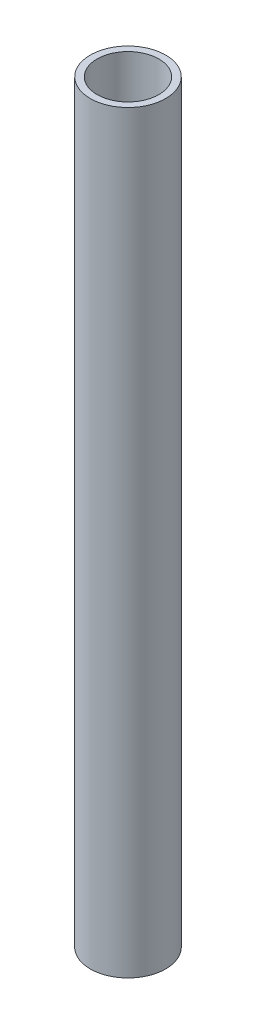
ISO-10303-21;
HEADER;
FILE_DESCRIPTION(('STEP AP214'),'2;1');
FILE_NAME('part.step','',(''),(''),'','','');
FILE_SCHEMA(('AUTOMOTIVE_DESIGN { 1 0 10303 214 1 1 1 1 }'));
ENDSEC;
DATA;
#1=APPLICATION_CONTEXT('core data for automotive mechanical design processes');
#2=APPLICATION_PROTOCOL_DEFINITION('international standard','automotive_design',2000,#1);
#3=PRODUCT_CONTEXT('',#1,'mechanical');
#4=PRODUCT('Part','Part','',(#3));
#5=PRODUCT_RELATED_PRODUCT_CATEGORY('part','',(#4));
#6=PRODUCT_DEFINITION_FORMATION('','',#4);
#7=PRODUCT_DEFINITION_CONTEXT('part definition',#1,'design');
#8=PRODUCT_DEFINITION('design','',#6,#7);
#9=PRODUCT_DEFINITION_SHAPE('','',#8);
#10=(LENGTH_UNIT() NAMED_UNIT(*) SI_UNIT(.MILLI.,.METRE.));
#11=(NAMED_UNIT(*) PLANE_ANGLE_UNIT() SI_UNIT($,.RADIAN.));
#12=(NAMED_UNIT(*) SI_UNIT($,.STERADIAN.) SOLID_ANGLE_UNIT());
#13=UNCERTAINTY_MEASURE_WITH_UNIT(LENGTH_MEASURE(1.E-05),#10,'distance_accuracy_value','');
#14=(GEOMETRIC_REPRESENTATION_CONTEXT(3) GLOBAL_UNCERTAINTY_ASSIGNED_CONTEXT((#13)) GLOBAL_UNIT_ASSIGNED_CONTEXT((#10,
#11,#12)) REPRESENTATION_CONTEXT('',''));
#15=CARTESIAN_POINT('',(0.,0.,0.));
#16=DIRECTION('',(0.,0.,1.));
#17=DIRECTION('',(1.,0.,0.));
#18=AXIS2_PLACEMENT_3D('',#15,#16,#17);
#19=CARTESIAN_POINT('',(0.,254.,0.));
#20=DIRECTION('',(0.,1.,0.));
#21=DIRECTION('',(0.,0.,1.));
#22=AXIS2_PLACEMENT_3D('',#19,#20,#21);
#23=PLANE('',#22);
#24=CARTESIAN_POINT('',(0.,254.,0.));
#25=DIRECTION('',(0.,1.,0.));
#26=DIRECTION('',(0.,0.,1.));
#27=AXIS2_PLACEMENT_3D('',#24,#25,#26);
#28=CIRCLE('',#27,12.7);
#29=CARTESIAN_POINT('',(0.,254.,12.7));
#30=VERTEX_POINT('',#29);
#31=EDGE_CURVE('E10',#30,#30,#28,.T.);
#32=ORIENTED_EDGE('',*,*,#31,.T.);
#33=EDGE_LOOP('',(#32));
#34=FACE_BOUND('',#33,.T.);
#35=CARTESIAN_POINT('',(0.,254.,0.));
#36=DIRECTION('',(0.,1.,0.));
#37=DIRECTION('',(0.,0.,1.));
#38=AXIS2_PLACEMENT_3D('',#35,#36,#37);
#39=CIRCLE('',#38,10.414);
#40=CARTESIAN_POINT('',(0.,254.,10.414));
#41=VERTEX_POINT('',#40);
#42=EDGE_CURVE('E42',#41,#41,#39,.T.);
#43=ORIENTED_EDGE('',*,*,#42,.F.);
#44=EDGE_LOOP('',(#43));
#45=FACE_BOUND('',#44,.T.);
#46=ADVANCED_FACE('F31',(#34,#45),#23,.T.);
#47=CARTESIAN_POINT('',(0.,0.,0.));
#48=DIRECTION('',(0.,1.,0.));
#49=DIRECTION('',(0.,0.,1.));
#50=AXIS2_PLACEMENT_3D('',#47,#48,#49);
#51=PLANE('',#50);
#52=CARTESIAN_POINT('',(0.,0.,0.));
#53=DIRECTION('',(0.,1.,0.));
#54=DIRECTION('',(0.,0.,1.));
#55=AXIS2_PLACEMENT_3D('',#52,#53,#54);
#56=CIRCLE('',#55,12.7);
#57=CARTESIAN_POINT('',(0.,0.,12.7));
#58=VERTEX_POINT('',#57);
#59=EDGE_CURVE('E35',#58,#58,#56,.T.);
#60=ORIENTED_EDGE('',*,*,#59,.F.);
#61=EDGE_LOOP('',(#60));
#62=FACE_BOUND('',#61,.T.);
#63=CARTESIAN_POINT('',(0.,0.,0.));
#64=DIRECTION('',(0.,1.,0.));
#65=DIRECTION('',(0.,0.,1.));
#66=AXIS2_PLACEMENT_3D('',#63,#64,#65);
#67=CIRCLE('',#66,10.414);
#68=CARTESIAN_POINT('',(0.,0.,10.414));
#69=VERTEX_POINT('',#68);
#70=EDGE_CURVE('E44',#69,#69,#67,.T.);
#71=ORIENTED_EDGE('',*,*,#70,.T.);
#72=EDGE_LOOP('',(#71));
#73=FACE_BOUND('',#72,.T.);
#74=ADVANCED_FACE('F54',(#62,#73),#51,.F.);
#75=CARTESIAN_POINT('',(0.,254.,0.));
#76=DIRECTION('',(0.,-1.,0.));
#77=DIRECTION('',(0.,0.,-1.));
#78=AXIS2_PLACEMENT_3D('',#75,#76,#77);
#79=CYLINDRICAL_SURFACE('',#78,12.7);
#80=ORIENTED_EDGE('',*,*,#31,.F.);
#81=EDGE_LOOP('',(#80));
#82=FACE_BOUND('',#81,.T.);
#83=ORIENTED_EDGE('',*,*,#59,.T.);
#84=EDGE_LOOP('',(#83));
#85=FACE_BOUND('',#84,.T.);
#86=ADVANCED_FACE('F33',(#82,#85),#79,.T.);
#87=CARTESIAN_POINT('',(0.,254.,0.));
#88=DIRECTION('',(0.,-1.,0.));
#89=DIRECTION('',(0.,0.,-1.));
#90=AXIS2_PLACEMENT_3D('',#87,#88,#89);
#91=CYLINDRICAL_SURFACE('',#90,10.414);
#92=ORIENTED_EDGE('',*,*,#42,.T.);
#93=EDGE_LOOP('',(#92));
#94=FACE_BOUND('',#93,.T.);
#95=ORIENTED_EDGE('',*,*,#70,.F.);
#96=EDGE_LOOP('',(#95));
#97=FACE_BOUND('',#96,.T.);
#98=ADVANCED_FACE('F50',(#94,#97),#91,.F.);
#99=CLOSED_SHELL('',(#46,#74,#86,#98));
#100=MANIFOLD_SOLID_BREP('B2',#99);
#101=ADVANCED_BREP_SHAPE_REPRESENTATION('',(#18,#100),#14);
#102=SHAPE_DEFINITION_REPRESENTATION(#9,#101);
ENDSEC;
END-ISO-10303-21;
